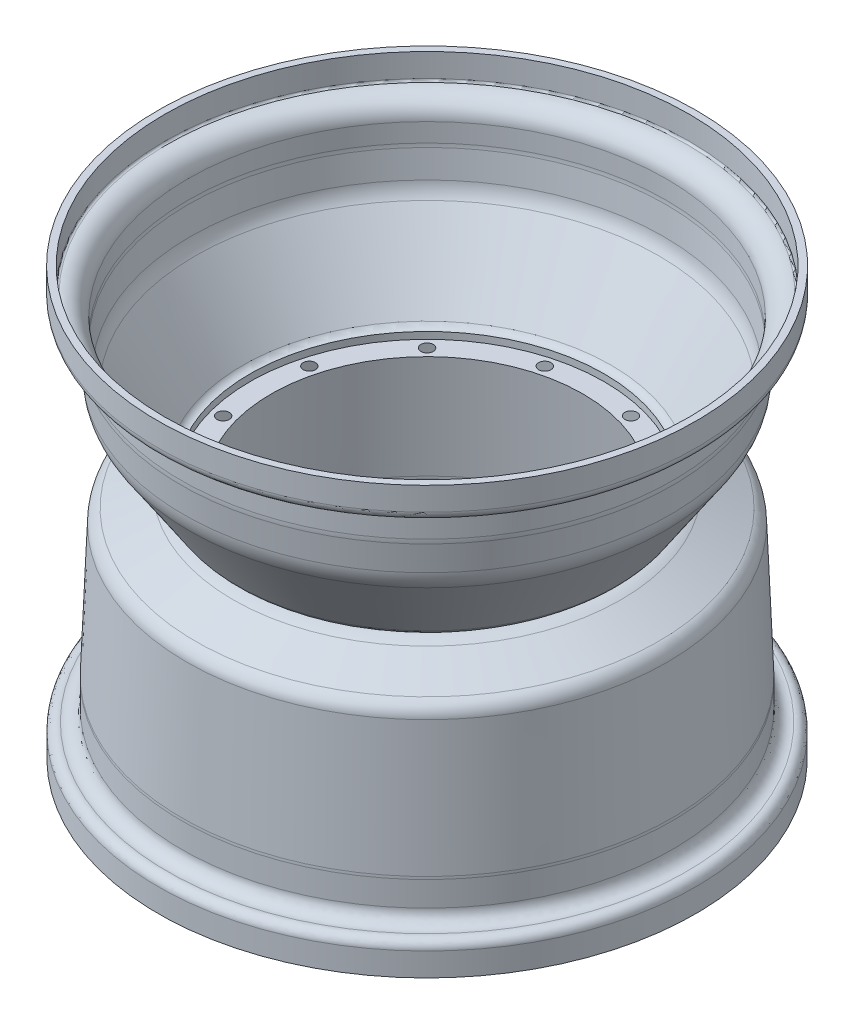
ISO-10303-21;
HEADER;
FILE_DESCRIPTION(('STEP AP214'),'2;1');
FILE_NAME('part.step','',(''),(''),'','','');
FILE_SCHEMA(('AUTOMOTIVE_DESIGN { 1 0 10303 214 1 1 1 1 }'));
ENDSEC;
DATA;
#1=APPLICATION_CONTEXT('core data for automotive mechanical design processes');
#2=APPLICATION_PROTOCOL_DEFINITION('international standard','automotive_design',2000,#1);
#3=PRODUCT_CONTEXT('',#1,'mechanical');
#4=PRODUCT('Part','Part','',(#3));
#5=PRODUCT_RELATED_PRODUCT_CATEGORY('part','',(#4));
#6=PRODUCT_DEFINITION_FORMATION('','',#4);
#7=PRODUCT_DEFINITION_CONTEXT('part definition',#1,'design');
#8=PRODUCT_DEFINITION('design','',#6,#7);
#9=PRODUCT_DEFINITION_SHAPE('','',#8);
#10=(LENGTH_UNIT() NAMED_UNIT(*) SI_UNIT(.MILLI.,.METRE.));
#11=(NAMED_UNIT(*) PLANE_ANGLE_UNIT() SI_UNIT($,.RADIAN.));
#12=(NAMED_UNIT(*) SI_UNIT($,.STERADIAN.) SOLID_ANGLE_UNIT());
#13=UNCERTAINTY_MEASURE_WITH_UNIT(LENGTH_MEASURE(1.E-05),#10,'distance_accuracy_value','');
#14=(GEOMETRIC_REPRESENTATION_CONTEXT(3) GLOBAL_UNCERTAINTY_ASSIGNED_CONTEXT((#13)) GLOBAL_UNIT_ASSIGNED_CONTEXT((#10,
#11,#12)) REPRESENTATION_CONTEXT('',''));
#15=CARTESIAN_POINT('',(0.,0.,0.));
#16=DIRECTION('',(0.,0.,1.));
#17=DIRECTION('',(1.,0.,0.));
#18=AXIS2_PLACEMENT_3D('',#15,#16,#17);
#19=CARTESIAN_POINT('',(0.,20.9847913738796,0.));
#20=DIRECTION('',(0.,-1.,0.));
#21=DIRECTION('',(0.,0.,-1.));
#22=AXIS2_PLACEMENT_3D('',#19,#20,#21);
#23=CYLINDRICAL_SURFACE('',#22,91.1860000000004);
#24=CARTESIAN_POINT('',(0.,16.5472913738795,0.));
#25=DIRECTION('',(0.,-1.,0.));
#26=DIRECTION('',(0.,0.,-1.));
#27=AXIS2_PLACEMENT_3D('',#24,#25,#26);
#28=CIRCLE('',#27,91.1860000000005);
#29=CARTESIAN_POINT('',(0.,16.5472913738795,-91.1860000000005));
#30=VERTEX_POINT('',#29);
#31=EDGE_CURVE('E64',#30,#30,#28,.T.);
#32=ORIENTED_EDGE('',*,*,#31,.F.);
#33=EDGE_LOOP('',(#32));
#34=FACE_BOUND('',#33,.T.);
#35=CARTESIAN_POINT('',(0.,13.0472913738795,0.));
#36=DIRECTION('',(0.,-1.,0.));
#37=DIRECTION('',(0.,0.,-1.));
#38=AXIS2_PLACEMENT_3D('',#35,#36,#37);
#39=CIRCLE('',#38,91.1860000000005);
#40=CARTESIAN_POINT('',(0.,13.0472913738795,-91.1860000000005));
#41=VERTEX_POINT('',#40);
#42=EDGE_CURVE('E68',#41,#41,#39,.T.);
#43=ORIENTED_EDGE('',*,*,#42,.T.);
#44=EDGE_LOOP('',(#43));
#45=FACE_BOUND('',#44,.T.);
#46=ADVANCED_FACE('F46',(#34,#45),#23,.F.);
#47=CARTESIAN_POINT('',(0.,110.365316058993,0.));
#48=DIRECTION('',(0.,1.,0.));
#49=DIRECTION('',(0.,0.,1.));
#50=AXIS2_PLACEMENT_3D('',#47,#48,#49);
#51=PLANE('',#50);
#52=CARTESIAN_POINT('',(0.,110.365316058993,0.));
#53=DIRECTION('',(0.,-1.,0.));
#54=DIRECTION('',(0.,0.,-1.));
#55=AXIS2_PLACEMENT_3D('',#52,#53,#54);
#56=CIRCLE('',#55,135.055289406168);
#57=CARTESIAN_POINT('',(0.,110.365316058993,-135.055289406168));
#58=VERTEX_POINT('',#57);
#59=EDGE_CURVE('E11',#58,#58,#56,.T.);
#60=ORIENTED_EDGE('',*,*,#59,.T.);
#61=EDGE_LOOP('',(#60));
#62=FACE_BOUND('',#61,.T.);
#63=CARTESIAN_POINT('',(0.,110.365316058993,0.));
#64=DIRECTION('',(0.,-1.,0.));
#65=DIRECTION('',(0.,0.,-1.));
#66=AXIS2_PLACEMENT_3D('',#63,#64,#65);
#67=CIRCLE('',#66,138.555289406168);
#68=CARTESIAN_POINT('',(0.,110.365316058993,-138.555289406168));
#69=VERTEX_POINT('',#68);
#70=EDGE_CURVE('E91',#69,#69,#67,.T.);
#71=ORIENTED_EDGE('',*,*,#70,.F.);
#72=EDGE_LOOP('',(#71));
#73=FACE_BOUND('',#72,.T.);
#74=ADVANCED_FACE('F116',(#62,#73),#51,.T.);
#75=CARTESIAN_POINT('',(0.,55.,0.));
#76=DIRECTION('',(0.,-1.,0.));
#77=DIRECTION('',(0.,0.,-1.));
#78=AXIS2_PLACEMENT_3D('',#75,#76,#77);
#79=CYLINDRICAL_SURFACE('',#78,135.055289406168);
#80=CARTESIAN_POINT('',(0.,98.2988444671979,0.));
#81=DIRECTION('',(0.,-1.,0.));
#82=DIRECTION('',(0.,0.,-1.));
#83=AXIS2_PLACEMENT_3D('',#80,#81,#82);
#84=CIRCLE('',#83,135.055289406168);
#85=CARTESIAN_POINT('',(0.,98.2988444671979,-135.055289406168));
#86=VERTEX_POINT('',#85);
#87=EDGE_CURVE('E53',#86,#86,#84,.T.);
#88=ORIENTED_EDGE('',*,*,#87,.T.);
#89=EDGE_LOOP('',(#88));
#90=FACE_BOUND('',#89,.T.);
#91=ORIENTED_EDGE('',*,*,#59,.F.);
#92=EDGE_LOOP('',(#91));
#93=FACE_BOUND('',#92,.T.);
#94=ADVANCED_FACE('F121',(#90,#93),#79,.F.);
#95=CARTESIAN_POINT('',(0.,98.2420105318187,0.));
#96=DIRECTION('',(0.,-1.,0.));
#97=DIRECTION('',(0.,0.,-1.));
#98=AXIS2_PLACEMENT_3D('',#95,#96,#97);
#99=TOROIDAL_SURFACE('',#98,134.112,0.944999999999911);
#100=CARTESIAN_POINT('',(0.,97.301747403753,0.));
#101=DIRECTION('',(0.,-1.,0.));
#102=DIRECTION('',(0.,0.,-1.));
#103=AXIS2_PLACEMENT_3D('',#100,#101,#102);
#104=CIRCLE('',#103,134.0175);
#105=CARTESIAN_POINT('',(0.,97.301747403753,-134.0175));
#106=VERTEX_POINT('',#105);
#107=EDGE_CURVE('E58',#106,#106,#104,.T.);
#108=ORIENTED_EDGE('',*,*,#107,.T.);
#109=EDGE_LOOP('',(#108));
#110=FACE_BOUND('',#109,.T.);
#111=ORIENTED_EDGE('',*,*,#87,.F.);
#112=EDGE_LOOP('',(#111));
#113=FACE_BOUND('',#112,.T.);
#114=ADVANCED_FACE('F191',(#110,#113),#99,.F.);
#115=CARTESIAN_POINT('',(0.,87.5011211482528,0.));
#116=DIRECTION('',(0.,-1.,0.));
#117=DIRECTION('',(0.,0.,-1.));
#118=AXIS2_PLACEMENT_3D('',#115,#116,#117);
#119=TOROIDAL_SURFACE('',#118,133.0325,9.84999999999996);
#120=CARTESIAN_POINT('',(0.,87.5011211482528,0.));
#121=DIRECTION('',(0.,-1.,0.));
#122=DIRECTION('',(0.,0.,-1.));
#123=AXIS2_PLACEMENT_3D('',#120,#121,#122);
#124=CIRCLE('',#123,123.1825);
#125=CARTESIAN_POINT('',(0.,87.5011211482528,-123.1825));
#126=VERTEX_POINT('',#125);
#127=EDGE_CURVE('E318',#126,#126,#124,.T.);
#128=ORIENTED_EDGE('',*,*,#127,.T.);
#129=EDGE_LOOP('',(#128));
#130=FACE_BOUND('',#129,.T.);
#131=ORIENTED_EDGE('',*,*,#107,.F.);
#132=EDGE_LOOP('',(#131));
#133=FACE_BOUND('',#132,.T.);
#134=ADVANCED_FACE('F187',(#130,#133),#119,.T.);
#135=CARTESIAN_POINT('',(0.,55.,0.));
#136=DIRECTION('',(0.,-1.,0.));
#137=DIRECTION('',(0.,0.,-1.));
#138=AXIS2_PLACEMENT_3D('',#135,#136,#137);
#139=CYLINDRICAL_SURFACE('',#138,123.1825);
#140=CARTESIAN_POINT('',(0.,77.9442913738797,0.));
#141=DIRECTION('',(0.,-1.,0.));
#142=DIRECTION('',(0.,0.,-1.));
#143=AXIS2_PLACEMENT_3D('',#140,#141,#142);
#144=CIRCLE('',#143,123.1825);
#145=CARTESIAN_POINT('',(0.,77.9442913738797,-123.1825));
#146=VERTEX_POINT('',#145);
#147=EDGE_CURVE('E321',#146,#146,#144,.T.);
#148=ORIENTED_EDGE('',*,*,#147,.T.);
#149=EDGE_LOOP('',(#148));
#150=FACE_BOUND('',#149,.T.);
#151=ORIENTED_EDGE('',*,*,#127,.F.);
#152=EDGE_LOOP('',(#151));
#153=FACE_BOUND('',#152,.T.);
#154=ADVANCED_FACE('F183',(#150,#153),#139,.F.);
#155=CARTESIAN_POINT('',(0.,77.9442913738795,0.));
#156=DIRECTION('',(0.,-1.,0.));
#157=DIRECTION('',(0.,0.,-1.));
#158=AXIS2_PLACEMENT_3D('',#155,#156,#157);
#159=TOROIDAL_SURFACE('',#158,101.2825,21.8999999999999);
#160=CARTESIAN_POINT('',(0.,76.0355806077061,0.));
#161=DIRECTION('',(0.,-1.,0.));
#162=DIRECTION('',(0.,0.,-1.));
#163=AXIS2_PLACEMENT_3D('',#160,#161,#162);
#164=CIRCLE('',#163,123.099163888209);
#165=CARTESIAN_POINT('',(0.,76.0355806077061,-123.099163888209));
#166=VERTEX_POINT('',#165);
#167=EDGE_CURVE('E326',#166,#166,#164,.T.);
#168=ORIENTED_EDGE('',*,*,#167,.T.);
#169=EDGE_LOOP('',(#168));
#170=FACE_BOUND('',#169,.T.);
#171=ORIENTED_EDGE('',*,*,#147,.F.);
#172=EDGE_LOOP('',(#171));
#173=FACE_BOUND('',#172,.T.);
#174=ADVANCED_FACE('F179',(#170,#173),#159,.F.);
#175=CARTESIAN_POINT('',(0.,76.0355806077062,0.));
#176=DIRECTION('',(0.,1.,0.));
#177=DIRECTION('',(0.,0.,1.));
#178=AXIS2_PLACEMENT_3D('',#175,#176,#177);
#179=CONICAL_SURFACE('',#178,123.099163888209,0.0872664625997217);
#180=CARTESIAN_POINT('',(0.,62.3743364734966,0.));
#181=DIRECTION('',(0.,1.,0.));
#182=DIRECTION('',(0.,0.,1.));
#183=AXIS2_PLACEMENT_3D('',#180,#181,#182);
#184=CIRCLE('',#183,121.903959896806);
#185=CARTESIAN_POINT('',(0.,62.3743364734966,121.903959896806));
#186=VERTEX_POINT('',#185);
#187=EDGE_CURVE('E329',#186,#186,#184,.F.);
#188=ORIENTED_EDGE('',*,*,#187,.T.);
#189=EDGE_LOOP('',(#188));
#190=FACE_BOUND('',#189,.T.);
#191=ORIENTED_EDGE('',*,*,#167,.F.);
#192=EDGE_LOOP('',(#191));
#193=FACE_BOUND('',#192,.T.);
#194=ADVANCED_FACE('F175',(#190,#193),#179,.F.);
#195=CARTESIAN_POINT('',(0.,63.7296082732224,0.));
#196=DIRECTION('',(0.,-1.,0.));
#197=DIRECTION('',(0.,0.,-1.));
#198=AXIS2_PLACEMENT_3D('',#195,#196,#197);
#199=TOROIDAL_SURFACE('',#198,106.413132341479,15.55);
#200=CARTESIAN_POINT('',(0.,55.0829549871006,0.));
#201=DIRECTION('',(0.,-1.,0.));
#202=DIRECTION('',(0.,0.,-1.));
#203=AXIS2_PLACEMENT_3D('',#200,#201,#202);
#204=CIRCLE('',#203,119.337446131758);
#205=CARTESIAN_POINT('',(0.,55.0829549871006,-119.337446131758));
#206=VERTEX_POINT('',#205);
#207=EDGE_CURVE('E67',#206,#206,#204,.T.);
#208=ORIENTED_EDGE('',*,*,#207,.T.);
#209=EDGE_LOOP('',(#208));
#210=FACE_BOUND('',#209,.T.);
#211=ORIENTED_EDGE('',*,*,#187,.F.);
#212=EDGE_LOOP('',(#211));
#213=FACE_BOUND('',#212,.T.);
#214=ADVANCED_FACE('F171',(#210,#213),#199,.F.);
#215=CARTESIAN_POINT('',(0.,55.0829549871006,0.));
#216=DIRECTION('',(0.,1.,0.));
#217=DIRECTION('',(0.,0.,1.));
#218=AXIS2_PLACEMENT_3D('',#215,#216,#217);
#219=CONICAL_SURFACE('',#218,119.337446131758,0.58963160852596);
#220=CARTESIAN_POINT('',(0.,18.517297871811,0.));
#221=DIRECTION('',(0.,1.,0.));
#222=DIRECTION('',(0.,0.,1.));
#223=AXIS2_PLACEMENT_3D('',#220,#221,#222);
#224=CIRCLE('',#223,94.8742085173229);
#225=CARTESIAN_POINT('',(0.,18.517297871811,94.8742085173229));
#226=VERTEX_POINT('',#225);
#227=EDGE_CURVE('E62',#226,#226,#224,.F.);
#228=ORIENTED_EDGE('',*,*,#227,.T.);
#229=EDGE_LOOP('',(#228));
#230=FACE_BOUND('',#229,.T.);
#231=ORIENTED_EDGE('',*,*,#207,.F.);
#232=EDGE_LOOP('',(#231));
#233=FACE_BOUND('',#232,.T.);
#234=ADVANCED_FACE('F112',(#230,#233),#219,.F.);
#235=CARTESIAN_POINT('',(0.,20.9847913738796,0.));
#236=DIRECTION('',(0.,-1.,0.));
#237=DIRECTION('',(0.,0.,-1.));
#238=AXIS2_PLACEMENT_3D('',#235,#236,#237);
#239=TOROIDAL_SURFACE('',#238,91.1860000000004,4.43750000000004);
#240=ORIENTED_EDGE('',*,*,#31,.T.);
#241=EDGE_LOOP('',(#240));
#242=FACE_BOUND('',#241,.T.);
#243=ORIENTED_EDGE('',*,*,#227,.F.);
#244=EDGE_LOOP('',(#243));
#245=FACE_BOUND('',#244,.T.);
#246=ADVANCED_FACE('F103',(#242,#245),#239,.F.);
#247=CARTESIAN_POINT('',(0.,55.,0.));
#248=DIRECTION('',(0.,-1.,0.));
#249=DIRECTION('',(0.,0.,-1.));
#250=AXIS2_PLACEMENT_3D('',#247,#248,#249);
#251=CYLINDRICAL_SURFACE('',#250,138.555289406168);
#252=CARTESIAN_POINT('',(0.,98.3653160589928,0.));
#253=DIRECTION('',(0.,-1.,0.));
#254=DIRECTION('',(0.,0.,-1.));
#255=AXIS2_PLACEMENT_3D('',#252,#253,#254);
#256=CIRCLE('',#255,138.555289406168);
#257=CARTESIAN_POINT('',(0.,98.3653160589928,-138.555289406168));
#258=VERTEX_POINT('',#257);
#259=EDGE_CURVE('E49',#258,#258,#256,.T.);
#260=ORIENTED_EDGE('',*,*,#259,.F.);
#261=EDGE_LOOP('',(#260));
#262=FACE_BOUND('',#261,.T.);
#263=ORIENTED_EDGE('',*,*,#70,.T.);
#264=EDGE_LOOP('',(#263));
#265=FACE_BOUND('',#264,.T.);
#266=ADVANCED_FACE('F101',(#262,#265),#251,.T.);
#267=CARTESIAN_POINT('',(0.,98.2420105318187,0.));
#268=DIRECTION('',(0.,-1.,0.));
#269=DIRECTION('',(0.,0.,-1.));
#270=AXIS2_PLACEMENT_3D('',#267,#268,#269);
#271=TOROIDAL_SURFACE('',#270,134.112,4.44499999999991);
#272=CARTESIAN_POINT('',(0.,93.8192913738798,0.));
#273=DIRECTION('',(0.,-1.,0.));
#274=DIRECTION('',(0.,0.,-1.));
#275=AXIS2_PLACEMENT_3D('',#272,#273,#274);
#276=CIRCLE('',#275,133.667500000001);
#277=CARTESIAN_POINT('',(0.,93.8192913738798,-133.667500000001));
#278=VERTEX_POINT('',#277);
#279=EDGE_CURVE('E89',#278,#278,#276,.T.);
#280=ORIENTED_EDGE('',*,*,#279,.F.);
#281=EDGE_LOOP('',(#280));
#282=FACE_BOUND('',#281,.T.);
#283=ORIENTED_EDGE('',*,*,#259,.T.);
#284=EDGE_LOOP('',(#283));
#285=FACE_BOUND('',#284,.T.);
#286=ADVANCED_FACE('F99',(#282,#285),#271,.T.);
#287=CARTESIAN_POINT('',(0.,87.5011211482528,0.));
#288=DIRECTION('',(0.,-1.,0.));
#289=DIRECTION('',(0.,0.,-1.));
#290=AXIS2_PLACEMENT_3D('',#287,#288,#289);
#291=TOROIDAL_SURFACE('',#290,133.0325,6.34999999999996);
#292=CARTESIAN_POINT('',(0.,87.5011211482528,0.));
#293=DIRECTION('',(0.,-1.,0.));
#294=DIRECTION('',(0.,0.,-1.));
#295=AXIS2_PLACEMENT_3D('',#292,#293,#294);
#296=CIRCLE('',#295,126.6825);
#297=CARTESIAN_POINT('',(0.,87.5011211482528,-126.6825));
#298=VERTEX_POINT('',#297);
#299=EDGE_CURVE('E86',#298,#298,#296,.T.);
#300=ORIENTED_EDGE('',*,*,#299,.F.);
#301=EDGE_LOOP('',(#300));
#302=FACE_BOUND('',#301,.T.);
#303=ORIENTED_EDGE('',*,*,#279,.T.);
#304=EDGE_LOOP('',(#303));
#305=FACE_BOUND('',#304,.T.);
#306=ADVANCED_FACE('F109',(#302,#305),#291,.F.);
#307=CARTESIAN_POINT('',(0.,55.,0.));
#308=DIRECTION('',(0.,-1.,0.));
#309=DIRECTION('',(0.,0.,-1.));
#310=AXIS2_PLACEMENT_3D('',#307,#308,#309);
#311=CYLINDRICAL_SURFACE('',#310,126.6825);
#312=CARTESIAN_POINT('',(0.,77.9442913738797,0.));
#313=DIRECTION('',(0.,-1.,0.));
#314=DIRECTION('',(0.,0.,-1.));
#315=AXIS2_PLACEMENT_3D('',#312,#313,#314);
#316=CIRCLE('',#315,126.6825);
#317=CARTESIAN_POINT('',(0.,77.9442913738797,-126.6825));
#318=VERTEX_POINT('',#317);
#319=EDGE_CURVE('E83',#318,#318,#316,.T.);
#320=ORIENTED_EDGE('',*,*,#319,.F.);
#321=EDGE_LOOP('',(#320));
#322=FACE_BOUND('',#321,.T.);
#323=ORIENTED_EDGE('',*,*,#299,.T.);
#324=EDGE_LOOP('',(#323));
#325=FACE_BOUND('',#324,.T.);
#326=ADVANCED_FACE('F153',(#322,#325),#311,.T.);
#327=CARTESIAN_POINT('',(0.,77.9442913738795,0.));
#328=DIRECTION('',(0.,-1.,0.));
#329=DIRECTION('',(0.,0.,-1.));
#330=AXIS2_PLACEMENT_3D('',#327,#328,#329);
#331=TOROIDAL_SURFACE('',#330,101.2825,25.3999999999999);
#332=CARTESIAN_POINT('',(0.,75.7305355080894,0.));
#333=DIRECTION('',(0.,-1.,0.));
#334=DIRECTION('',(0.,0.,-1.));
#335=AXIS2_PLACEMENT_3D('',#332,#333,#334);
#336=CIRCLE('',#335,126.58584533153);
#337=CARTESIAN_POINT('',(0.,75.7305355080894,-126.58584533153));
#338=VERTEX_POINT('',#337);
#339=EDGE_CURVE('E80',#338,#338,#336,.T.);
#340=ORIENTED_EDGE('',*,*,#339,.F.);
#341=EDGE_LOOP('',(#340));
#342=FACE_BOUND('',#341,.T.);
#343=ORIENTED_EDGE('',*,*,#319,.T.);
#344=EDGE_LOOP('',(#343));
#345=FACE_BOUND('',#344,.T.);
#346=ADVANCED_FACE('F147',(#342,#345),#331,.T.);
#347=CARTESIAN_POINT('',(0.,75.7305355080894,0.));
#348=DIRECTION('',(0.,1.,0.));
#349=DIRECTION('',(0.,0.,1.));
#350=AXIS2_PLACEMENT_3D('',#347,#348,#349);
#351=CONICAL_SURFACE('',#350,126.58584533153,0.0872664625997217);
#352=CARTESIAN_POINT('',(0.,62.0692913738798,0.));
#353=DIRECTION('',(0.,-1.,0.));
#354=DIRECTION('',(0.,0.,-1.));
#355=AXIS2_PLACEMENT_3D('',#352,#353,#354);
#356=CIRCLE('',#355,125.390641340127);
#357=CARTESIAN_POINT('',(0.,62.0692913738798,-125.390641340127));
#358=VERTEX_POINT('',#357);
#359=EDGE_CURVE('E77',#358,#358,#356,.T.);
#360=ORIENTED_EDGE('',*,*,#359,.F.);
#361=EDGE_LOOP('',(#360));
#362=FACE_BOUND('',#361,.T.);
#363=ORIENTED_EDGE('',*,*,#339,.T.);
#364=EDGE_LOOP('',(#363));
#365=FACE_BOUND('',#364,.T.);
#366=ADVANCED_FACE('F141',(#362,#365),#351,.T.);
#367=CARTESIAN_POINT('',(0.,63.7296082732224,0.));
#368=DIRECTION('',(0.,-1.,0.));
#369=DIRECTION('',(0.,0.,-1.));
#370=AXIS2_PLACEMENT_3D('',#367,#368,#369);
#371=TOROIDAL_SURFACE('',#370,106.413132341479,19.05);
#372=CARTESIAN_POINT('',(0.,53.1367629291311,0.));
#373=DIRECTION('',(0.,-1.,0.));
#374=DIRECTION('',(0.,0.,-1.));
#375=AXIS2_PLACEMENT_3D('',#372,#373,#374);
#376=CIRCLE('',#375,122.246455666548);
#377=CARTESIAN_POINT('',(0.,53.1367629291311,-122.246455666548));
#378=VERTEX_POINT('',#377);
#379=EDGE_CURVE('E71',#378,#378,#376,.T.);
#380=ORIENTED_EDGE('',*,*,#379,.F.);
#381=EDGE_LOOP('',(#380));
#382=FACE_BOUND('',#381,.T.);
#383=ORIENTED_EDGE('',*,*,#359,.T.);
#384=EDGE_LOOP('',(#383));
#385=FACE_BOUND('',#384,.T.);
#386=ADVANCED_FACE('F135',(#382,#385),#371,.T.);
#387=CARTESIAN_POINT('',(0.,53.1367629291311,0.));
#388=DIRECTION('',(0.,1.,0.));
#389=DIRECTION('',(0.,0.,1.));
#390=AXIS2_PLACEMENT_3D('',#387,#388,#389);
#391=CONICAL_SURFACE('',#390,122.246455666548,0.58963160852596);
#392=CARTESIAN_POINT('',(0.,16.5711058138414,0.));
#393=DIRECTION('',(0.,-1.,0.));
#394=DIRECTION('',(0.,0.,-1.));
#395=AXIS2_PLACEMENT_3D('',#392,#393,#394);
#396=CIRCLE('',#395,97.7832180521124);
#397=CARTESIAN_POINT('',(0.,16.5711058138414,-97.7832180521124));
#398=VERTEX_POINT('',#397);
#399=EDGE_CURVE('E72',#398,#398,#396,.T.);
#400=ORIENTED_EDGE('',*,*,#399,.F.);
#401=EDGE_LOOP('',(#400));
#402=FACE_BOUND('',#401,.T.);
#403=ORIENTED_EDGE('',*,*,#379,.T.);
#404=EDGE_LOOP('',(#403));
#405=FACE_BOUND('',#404,.T.);
#406=ADVANCED_FACE('F129',(#402,#405),#391,.T.);
#407=CARTESIAN_POINT('',(0.,20.9847913738796,0.));
#408=DIRECTION('',(0.,-1.,0.));
#409=DIRECTION('',(0.,0.,-1.));
#410=AXIS2_PLACEMENT_3D('',#407,#408,#409);
#411=TOROIDAL_SURFACE('',#410,91.1860000000004,7.93750000000004);
#412=ORIENTED_EDGE('',*,*,#42,.F.);
#413=EDGE_LOOP('',(#412));
#414=FACE_BOUND('',#413,.T.);
#415=ORIENTED_EDGE('',*,*,#399,.T.);
#416=EDGE_LOOP('',(#415));
#417=FACE_BOUND('',#416,.T.);
#418=ADVANCED_FACE('F126',(#414,#417),#411,.T.);
#419=CLOSED_SHELL('',(#46,#74,#94,#114,#134,#154,#174,#194,#214,#234,#246,#266,#286,#306,#326,
#346,#366,#386,#406,#418));
#420=MANIFOLD_SOLID_BREP('B2',#419);
#421=CARTESIAN_POINT('',(0.,55.,0.));
#422=DIRECTION('',(0.,-1.,0.));
#423=DIRECTION('',(0.,0.,-1.));
#424=AXIS2_PLACEMENT_3D('',#421,#422,#423);
#425=CYLINDRICAL_SURFACE('',#424,138.427487940002);
#426=CARTESIAN_POINT('',(0.,-97.4001828184885,0.));
#427=DIRECTION('',(0.,-1.,0.));
#428=DIRECTION('',(0.,0.,-1.));
#429=AXIS2_PLACEMENT_3D('',#426,#427,#428);
#430=CIRCLE('',#429,138.427487940002);
#431=CARTESIAN_POINT('',(0.,-97.4001828184885,-138.427487940002));
#432=VERTEX_POINT('',#431);
#433=EDGE_CURVE('E357',#432,#432,#430,.T.);
#434=ORIENTED_EDGE('',*,*,#433,.T.);
#435=EDGE_LOOP('',(#434));
#436=FACE_BOUND('',#435,.T.);
#437=CARTESIAN_POINT('',(0.,-109.400182818489,0.));
#438=DIRECTION('',(0.,-1.,0.));
#439=DIRECTION('',(0.,0.,-1.));
#440=AXIS2_PLACEMENT_3D('',#437,#438,#439);
#441=CIRCLE('',#440,138.427487940002);
#442=CARTESIAN_POINT('',(0.,-109.400182818489,-138.427487940002));
#443=VERTEX_POINT('',#442);
#444=EDGE_CURVE('E45',#443,#443,#441,.T.);
#445=ORIENTED_EDGE('',*,*,#444,.F.);
#446=EDGE_LOOP('',(#445));
#447=FACE_BOUND('',#446,.T.);
#448=ADVANCED_FACE('F355',(#436,#447),#425,.T.);
#449=CARTESIAN_POINT('',(0.,-97.4001828184885,138.427487940002));
#450=CARTESIAN_POINT('',(0.,-95.0050608254273,138.427487940002));
#451=CARTESIAN_POINT('',(0.,-92.6729013501488,136.705561076159));
#452=CARTESIAN_POINT('',(0.,-93.1247086261212,133.519735500002));
#453=(BOUNDED_CURVE() B_SPLINE_CURVE(3,(#449,#450,#451,#452),.UNSPECIFIED.,.F.,
.F.) B_SPLINE_CURVE_WITH_KNOTS((4,4),(0.,1.),
.UNSPECIFIED.) CURVE() GEOMETRIC_REPRESENTATION_ITEM() RATIONAL_B_SPLINE_CURVE((0.508666190060503,
0.327183181081988,0.242825015050017,0.255591691964592)) REPRESENTATION_ITEM(''));
#454=CARTESIAN_POINT('',(0.,55.,0.));
#455=DIRECTION('',(0.,-1.,0.));
#456=AXIS1_PLACEMENT('',#454,#455);
#457=SURFACE_OF_REVOLUTION('',#453,#456);
#458=CARTESIAN_POINT('',(0.,-93.1247086261212,0.));
#459=DIRECTION('',(0.,-1.,0.));
#460=DIRECTION('',(0.,0.,-1.));
#461=AXIS2_PLACEMENT_3D('',#458,#459,#460);
#462=CIRCLE('',#461,133.519735500002);
#463=CARTESIAN_POINT('',(0.,-93.1247086261212,-133.519735500002));
#464=VERTEX_POINT('',#463);
#465=EDGE_CURVE('E366',#464,#464,#462,.T.);
#466=ORIENTED_EDGE('',*,*,#465,.T.);
#467=EDGE_LOOP('',(#466));
#468=FACE_BOUND('',#467,.T.);
#469=ORIENTED_EDGE('',*,*,#433,.F.);
#470=EDGE_LOOP('',(#469));
#471=FACE_BOUND('',#470,.T.);
#472=ADVANCED_FACE('F405',(#468,#471),#457,.F.);
#473=CARTESIAN_POINT('',(0.,-93.1247086261212,133.519735500002));
#474=CARTESIAN_POINT('',(0.,-93.7891310907864,128.834697888006));
#475=CARTESIAN_POINT('',(0.,-90.3594848036121,126.302452500002));
#476=CARTESIAN_POINT('',(0.,-86.8372465785219,126.302452500002));
#477=(BOUNDED_CURVE() B_SPLINE_CURVE(3,(#473,#474,#475,#476),.UNSPECIFIED.,.F.,
.F.) B_SPLINE_CURVE_WITH_KNOTS((4,4),(0.,1.),
.UNSPECIFIED.) CURVE() GEOMETRIC_REPRESENTATION_ITEM() RATIONAL_B_SPLINE_CURVE((0.255591691964593,
0.242825015050018,0.327183181081988,0.508666190060503)) REPRESENTATION_ITEM(''));
#478=CARTESIAN_POINT('',(0.,55.,0.));
#479=DIRECTION('',(0.,-1.,0.));
#480=AXIS1_PLACEMENT('',#478,#479);
#481=SURFACE_OF_REVOLUTION('',#477,#480);
#482=CARTESIAN_POINT('',(0.,-86.8372465785219,0.));
#483=DIRECTION('',(0.,-1.,0.));
#484=DIRECTION('',(0.,0.,-1.));
#485=AXIS2_PLACEMENT_3D('',#482,#483,#484);
#486=CIRCLE('',#485,126.302452500002);
#487=CARTESIAN_POINT('',(0.,-86.8372465785219,-126.302452500002));
#488=VERTEX_POINT('',#487);
#489=EDGE_CURVE('E370',#488,#488,#486,.T.);
#490=ORIENTED_EDGE('',*,*,#489,.T.);
#491=EDGE_LOOP('',(#490));
#492=FACE_BOUND('',#491,.T.);
#493=ORIENTED_EDGE('',*,*,#465,.F.);
#494=EDGE_LOOP('',(#493));
#495=FACE_BOUND('',#494,.T.);
#496=ADVANCED_FACE('F408',(#492,#495),#481,.F.);
#497=CARTESIAN_POINT('',(0.,55.,0.));
#498=DIRECTION('',(0.,-1.,0.));
#499=DIRECTION('',(0.,0.,-1.));
#500=AXIS2_PLACEMENT_3D('',#497,#498,#499);
#501=CYLINDRICAL_SURFACE('',#500,126.302452500002);
#502=CARTESIAN_POINT('',(0.,-74.0828852821459,0.));
#503=DIRECTION('',(0.,-1.,0.));
#504=DIRECTION('',(0.,0.,-1.));
#505=AXIS2_PLACEMENT_3D('',#502,#503,#504);
#506=CIRCLE('',#505,126.302452500002);
#507=CARTESIAN_POINT('',(0.,-74.0828852821459,-126.302452500002));
#508=VERTEX_POINT('',#507);
#509=EDGE_CURVE('E373',#508,#508,#506,.T.);
#510=ORIENTED_EDGE('',*,*,#509,.T.);
#511=EDGE_LOOP('',(#510));
#512=FACE_BOUND('',#511,.T.);
#513=ORIENTED_EDGE('',*,*,#489,.F.);
#514=EDGE_LOOP('',(#513));
#515=FACE_BOUND('',#514,.T.);
#516=ADVANCED_FACE('F412',(#512,#515),#501,.T.);
#517=CARTESIAN_POINT('',(0.,-74.0828852821458,0.));
#518=DIRECTION('',(0.,-1.,0.));
#519=DIRECTION('',(0.,0.,-1.));
#520=AXIS2_PLACEMENT_3D('',#517,#518,#519);
#521=TOROIDAL_SURFACE('',#520,91.302452500002,35.);
#522=CARTESIAN_POINT('',(0.,-72.7393119640824,0.));
#523=DIRECTION('',(0.,-1.,0.));
#524=DIRECTION('',(0.,0.,-1.));
#525=AXIS2_PLACEMENT_3D('',#522,#523,#524);
#526=CIRCLE('',#525,126.276654574374);
#527=CARTESIAN_POINT('',(0.,-72.7393119640824,-126.276654574374));
#528=VERTEX_POINT('',#527);
#529=EDGE_CURVE('E376',#528,#528,#526,.T.);
#530=ORIENTED_EDGE('',*,*,#529,.T.);
#531=EDGE_LOOP('',(#530));
#532=FACE_BOUND('',#531,.T.);
#533=ORIENTED_EDGE('',*,*,#509,.F.);
#534=EDGE_LOOP('',(#533));
#535=FACE_BOUND('',#534,.T.);
#536=ADVANCED_FACE('F422',(#532,#535),#521,.T.);
#537=CARTESIAN_POINT('',(0.,-72.7393119640824,0.));
#538=DIRECTION('',(0.,-1.,0.));
#539=DIRECTION('',(0.,0.,-1.));
#540=AXIS2_PLACEMENT_3D('',#537,#538,#539);
#541=CONICAL_SURFACE('',#540,126.276654574374,0.0383972435438753);
#542=CARTESIAN_POINT('',(0.,-4.67176492476311,0.));
#543=DIRECTION('',(0.,-1.,0.));
#544=DIRECTION('',(0.,0.,-1.));
#545=AXIS2_PLACEMENT_3D('',#542,#543,#544);
#546=CIRCLE('',#545,123.661763180038);
#547=CARTESIAN_POINT('',(0.,-4.67176492476311,-123.661763180038));
#548=VERTEX_POINT('',#547);
#549=EDGE_CURVE('E379',#548,#548,#546,.T.);
#550=ORIENTED_EDGE('',*,*,#549,.T.);
#551=EDGE_LOOP('',(#550));
#552=FACE_BOUND('',#551,.T.);
#553=ORIENTED_EDGE('',*,*,#529,.F.);
#554=EDGE_LOOP('',(#553));
#555=FACE_BOUND('',#554,.T.);
#556=ADVANCED_FACE('F426',(#552,#555),#541,.T.);
#557=CARTESIAN_POINT('',(0.,-4.97886739746323,0.));
#558=DIRECTION('',(0.,-1.,0.));
#559=DIRECTION('',(0.,0.,-1.));
#560=AXIS2_PLACEMENT_3D('',#557,#558,#559);
#561=TOROIDAL_SURFACE('',#560,115.667659848753,8.);
#562=CARTESIAN_POINT('',(0.,2.26769556187344,0.));
#563=DIRECTION('',(0.,-1.,0.));
#564=DIRECTION('',(0.,0.,-1.));
#565=AXIS2_PLACEMENT_3D('',#562,#563,#564);
#566=CIRCLE('',#565,119.056955539065);
#567=CARTESIAN_POINT('',(0.,2.26769556187344,-119.056955539065));
#568=VERTEX_POINT('',#567);
#569=EDGE_CURVE('E382',#568,#568,#566,.T.);
#570=ORIENTED_EDGE('',*,*,#569,.T.);
#571=EDGE_LOOP('',(#570));
#572=FACE_BOUND('',#571,.T.);
#573=ORIENTED_EDGE('',*,*,#549,.F.);
#574=EDGE_LOOP('',(#573));
#575=FACE_BOUND('',#574,.T.);
#576=ADVANCED_FACE('F430',(#572,#575),#561,.T.);
#577=CARTESIAN_POINT('',(0.,2.26769556187344,0.));
#578=DIRECTION('',(0.,-1.,0.));
#579=DIRECTION('',(0.,0.,-1.));
#580=AXIS2_PLACEMENT_3D('',#577,#578,#579);
#581=CONICAL_SURFACE('',#580,119.056955539065,1.13331210913777);
#582=CARTESIAN_POINT('',(0.,11.2624547169263,0.));
#583=DIRECTION('',(0.,-1.,0.));
#584=DIRECTION('',(0.,0.,-1.));
#585=AXIS2_PLACEMENT_3D('',#582,#583,#584);
#586=CIRCLE('',#585,99.8255002525088);
#587=CARTESIAN_POINT('',(0.,11.2624547169263,-99.8255002525088));
#588=VERTEX_POINT('',#587);
#589=EDGE_CURVE('E385',#588,#588,#586,.T.);
#590=ORIENTED_EDGE('',*,*,#589,.T.);
#591=EDGE_LOOP('',(#590));
#592=FACE_BOUND('',#591,.T.);
#593=ORIENTED_EDGE('',*,*,#569,.F.);
#594=EDGE_LOOP('',(#593));
#595=FACE_BOUND('',#594,.T.);
#596=ADVANCED_FACE('F434',(#592,#595),#581,.T.);
#597=CARTESIAN_POINT('',(0.,11.2624547169263,99.8255002525088));
#598=CARTESIAN_POINT('',(0.,12.4331662406384,97.3224330848818));
#599=CARTESIAN_POINT('',(0.,13.0472913738793,94.605850648923));
#600=CARTESIAN_POINT('',(0.,13.0472913738795,91.7987750000028));
#601=(BOUNDED_CURVE() B_SPLINE_CURVE(3,(#597,#598,#599,#600),.UNSPECIFIED.,.F.,
.F.) B_SPLINE_CURVE_WITH_KNOTS((4,4),(0.,1.),
.UNSPECIFIED.) CURVE() GEOMETRIC_REPRESENTATION_ITEM() RATIONAL_B_SPLINE_CURVE((0.266833191114025,
0.258499793724843,0.254333095030252,0.254333095030252)) REPRESENTATION_ITEM(''));
#602=CARTESIAN_POINT('',(0.,55.,0.));
#603=DIRECTION('',(0.,-1.,0.));
#604=AXIS1_PLACEMENT('',#602,#603);
#605=SURFACE_OF_REVOLUTION('',#601,#604);
#606=CARTESIAN_POINT('',(0.,13.0472913738795,0.));
#607=DIRECTION('',(0.,-1.,0.));
#608=DIRECTION('',(0.,0.,-1.));
#609=AXIS2_PLACEMENT_3D('',#606,#607,#608);
#610=CIRCLE('',#609,91.7987750000028);
#611=CARTESIAN_POINT('',(0.,13.0472913738795,-91.7987750000028));
#612=VERTEX_POINT('',#611);
#613=EDGE_CURVE('E389',#612,#612,#610,.T.);
#614=ORIENTED_EDGE('',*,*,#613,.T.);
#615=EDGE_LOOP('',(#614));
#616=FACE_BOUND('',#615,.T.);
#617=ORIENTED_EDGE('',*,*,#589,.F.);
#618=EDGE_LOOP('',(#617));
#619=FACE_BOUND('',#618,.T.);
#620=ADVANCED_FACE('F438',(#616,#619),#605,.F.);
#621=CARTESIAN_POINT('',(0.,13.0472913738795,91.7987750000028));
#622=DIRECTION('',(0.,1.,0.));
#623=DIRECTION('',(0.,0.,1.));
#624=AXIS2_PLACEMENT_3D('',#621,#622,#623);
#625=PLANE('',#624);
#626=CARTESIAN_POINT('',(0.,13.0472913738796,0.));
#627=DIRECTION('',(0.,-1.,0.));
#628=DIRECTION('',(0.,0.,-1.));
#629=AXIS2_PLACEMENT_3D('',#626,#627,#628);
#630=CIRCLE('',#629,91.1860000000005);
#631=CARTESIAN_POINT('',(0.,13.0472913738796,-91.1860000000005));
#632=VERTEX_POINT('',#631);
#633=EDGE_CURVE('E388',#632,#632,#630,.T.);
#634=ORIENTED_EDGE('',*,*,#633,.T.);
#635=EDGE_LOOP('',(#634));
#636=FACE_BOUND('',#635,.T.);
#637=ORIENTED_EDGE('',*,*,#613,.F.);
#638=EDGE_LOOP('',(#637));
#639=FACE_BOUND('',#638,.T.);
#640=ADVANCED_FACE('F442',(#636,#639),#625,.T.);
#641=OPEN_SHELL('',(#448,#472,#496,#516,#536,#556,#576,#596,#620,#640));
#642=SHELL_BASED_SURFACE_MODEL('B6',(#641));
#643=CARTESIAN_POINT('',(0.,13.0472913738795,91.1860000000005));
#644=DIRECTION('',(0.,1.,0.));
#645=DIRECTION('',(0.,0.,1.));
#646=AXIS2_PLACEMENT_3D('',#643,#644,#645);
#647=PLANE('',#646);
#648=CARTESIAN_POINT('',(-60.6167288172175,13.0472913738795,60.6167288172161));
#649=DIRECTION('',(0.,1.,0.));
#650=DIRECTION('',(0.,0.,1.));
#651=AXIS2_PLACEMENT_3D('',#648,#649,#650);
#652=CIRCLE('',#651,3.175);
#653=CARTESIAN_POINT('',(-60.6167288172175,13.0472913738795,63.7917288172161));
#654=VERTEX_POINT('',#653);
#655=EDGE_CURVE('E354',#654,#654,#652,.T.);
#656=ORIENTED_EDGE('',*,*,#655,.F.);
#657=EDGE_LOOP('',(#656));
#658=FACE_BOUND('',#657,.T.);
#659=CARTESIAN_POINT('',(-22.1872626414145,13.0472913738795,82.8039914586301));
#660=DIRECTION('',(0.,1.,0.));
#661=DIRECTION('',(0.,0.,1.));
#662=AXIS2_PLACEMENT_3D('',#659,#660,#661);
#663=CIRCLE('',#662,3.175);
#664=CARTESIAN_POINT('',(-22.1872626414145,13.0472913738795,85.9789914586301));
#665=VERTEX_POINT('',#664);
#666=EDGE_CURVE('E543',#665,#665,#663,.T.);
#667=ORIENTED_EDGE('',*,*,#666,.F.);
#668=EDGE_LOOP('',(#667));
#669=FACE_BOUND('',#668,.T.);
#670=CARTESIAN_POINT('',(22.1872626414128,13.0472913738795,82.8039914586306));
#671=DIRECTION('',(0.,1.,0.));
#672=DIRECTION('',(0.,0.,1.));
#673=AXIS2_PLACEMENT_3D('',#670,#671,#672);
#674=CIRCLE('',#673,3.175);
#675=CARTESIAN_POINT('',(22.1872626414128,13.0472913738795,85.9789914586306));
#676=VERTEX_POINT('',#675);
#677=EDGE_CURVE('E550',#676,#676,#674,.T.);
#678=ORIENTED_EDGE('',*,*,#677,.F.);
#679=EDGE_LOOP('',(#678));
#680=FACE_BOUND('',#679,.T.);
#681=CARTESIAN_POINT('',(60.6167288172163,13.0472913738795,60.6167288172173));
#682=DIRECTION('',(0.,1.,0.));
#683=DIRECTION('',(0.,0.,1.));
#684=AXIS2_PLACEMENT_3D('',#681,#682,#683);
#685=CIRCLE('',#684,3.17499999999999);
#686=CARTESIAN_POINT('',(60.6167288172163,13.0472913738795,63.7917288172172));
#687=VERTEX_POINT('',#686);
#688=EDGE_CURVE('E556',#687,#687,#685,.T.);
#689=ORIENTED_EDGE('',*,*,#688,.F.);
#690=EDGE_LOOP('',(#689));
#691=FACE_BOUND('',#690,.T.);
#692=CARTESIAN_POINT('',(82.8039914586302,13.0472913738795,22.1872626414142));
#693=DIRECTION('',(0.,1.,0.));
#694=DIRECTION('',(0.,0.,1.));
#695=AXIS2_PLACEMENT_3D('',#692,#693,#694);
#696=CIRCLE('',#695,3.17499999999999);
#697=CARTESIAN_POINT('',(82.8039914586302,13.0472913738795,25.3622626414142));
#698=VERTEX_POINT('',#697);
#699=EDGE_CURVE('E562',#698,#698,#696,.T.);
#700=ORIENTED_EDGE('',*,*,#699,.F.);
#701=EDGE_LOOP('',(#700));
#702=FACE_BOUND('',#701,.T.);
#703=CARTESIAN_POINT('',(82.8039914586305,13.0472913738795,-22.1872626414131));
#704=DIRECTION('',(0.,1.,0.));
#705=DIRECTION('',(0.,0.,1.));
#706=AXIS2_PLACEMENT_3D('',#703,#704,#705);
#707=CIRCLE('',#706,3.17499999999999);
#708=CARTESIAN_POINT('',(82.8039914586305,13.0472913738795,-19.0122626414131));
#709=VERTEX_POINT('',#708);
#710=EDGE_CURVE('E566',#709,#709,#707,.T.);
#711=ORIENTED_EDGE('',*,*,#710,.F.);
#712=EDGE_LOOP('',(#711));
#713=FACE_BOUND('',#712,.T.);
#714=CARTESIAN_POINT('',(60.6167288172171,13.0472913738795,-60.6167288172165));
#715=DIRECTION('',(0.,1.,0.));
#716=DIRECTION('',(0.,0.,1.));
#717=AXIS2_PLACEMENT_3D('',#714,#715,#716);
#718=CIRCLE('',#717,3.175);
#719=CARTESIAN_POINT('',(60.6167288172171,13.0472913738795,-57.4417288172165));
#720=VERTEX_POINT('',#719);
#721=EDGE_CURVE('E570',#720,#720,#718,.T.);
#722=ORIENTED_EDGE('',*,*,#721,.F.);
#723=EDGE_LOOP('',(#722));
#724=FACE_BOUND('',#723,.T.);
#725=CARTESIAN_POINT('',(22.1872626414139,13.0472913738795,-82.8039914586303));
#726=DIRECTION('',(0.,1.,0.));
#727=DIRECTION('',(0.,0.,1.));
#728=AXIS2_PLACEMENT_3D('',#725,#726,#727);
#729=CIRCLE('',#728,3.17499999999999);
#730=CARTESIAN_POINT('',(22.1872626414139,13.0472913738795,-79.6289914586303));
#731=VERTEX_POINT('',#730);
#732=EDGE_CURVE('E574',#731,#731,#729,.T.);
#733=ORIENTED_EDGE('',*,*,#732,.F.);
#734=EDGE_LOOP('',(#733));
#735=FACE_BOUND('',#734,.T.);
#736=CARTESIAN_POINT('',(-22.1872626414134,13.0472913738795,-82.8039914586304));
#737=DIRECTION('',(0.,1.,0.));
#738=DIRECTION('',(0.,0.,1.));
#739=AXIS2_PLACEMENT_3D('',#736,#737,#738);
#740=CIRCLE('',#739,3.17500000000001);
#741=CARTESIAN_POINT('',(-22.1872626414134,13.0472913738795,-79.6289914586304));
#742=VERTEX_POINT('',#741);
#743=EDGE_CURVE('E578',#742,#742,#740,.T.);
#744=ORIENTED_EDGE('',*,*,#743,.F.);
#745=EDGE_LOOP('',(#744));
#746=FACE_BOUND('',#745,.T.);
#747=CARTESIAN_POINT('',(-60.6167288172167,13.0472913738795,-60.6167288172169));
#748=DIRECTION('',(0.,1.,0.));
#749=DIRECTION('',(0.,0.,1.));
#750=AXIS2_PLACEMENT_3D('',#747,#748,#749);
#751=CIRCLE('',#750,3.175);
#752=CARTESIAN_POINT('',(-60.6167288172167,13.0472913738795,-57.4417288172169));
#753=VERTEX_POINT('',#752);
#754=EDGE_CURVE('E582',#753,#753,#751,.T.);
#755=ORIENTED_EDGE('',*,*,#754,.F.);
#756=EDGE_LOOP('',(#755));
#757=FACE_BOUND('',#756,.T.);
#758=CARTESIAN_POINT('',(-82.8039914586303,13.0472913738795,-22.1872626414136));
#759=DIRECTION('',(0.,1.,0.));
#760=DIRECTION('',(0.,0.,1.));
#761=AXIS2_PLACEMENT_3D('',#758,#759,#760);
#762=CIRCLE('',#761,3.17499999999998);
#763=CARTESIAN_POINT('',(-82.8039914586303,13.0472913738795,-19.0122626414136));
#764=VERTEX_POINT('',#763);
#765=EDGE_CURVE('E586',#764,#764,#762,.T.);
#766=ORIENTED_EDGE('',*,*,#765,.F.);
#767=EDGE_LOOP('',(#766));
#768=FACE_BOUND('',#767,.T.);
#769=CARTESIAN_POINT('',(-82.8039914586303,13.0472913738795,22.1872626414137));
#770=DIRECTION('',(0.,1.,0.));
#771=DIRECTION('',(0.,0.,1.));
#772=AXIS2_PLACEMENT_3D('',#769,#770,#771);
#773=CIRCLE('',#772,3.175);
#774=CARTESIAN_POINT('',(-82.8039914586303,13.0472913738795,25.3622626414137));
#775=VERTEX_POINT('',#774);
#776=EDGE_CURVE('E590',#775,#775,#773,.T.);
#777=ORIENTED_EDGE('',*,*,#776,.F.);
#778=EDGE_LOOP('',(#777));
#779=FACE_BOUND('',#778,.T.);
#780=CARTESIAN_POINT('',(0.,13.0472913738795,0.));
#781=DIRECTION('',(0.,-1.,0.));
#782=DIRECTION('',(0.,0.,-1.));
#783=AXIS2_PLACEMENT_3D('',#780,#781,#782);
#784=CIRCLE('',#783,80.2640000000005);
#785=CARTESIAN_POINT('',(0.,13.0472913738795,-80.2640000000005));
#786=VERTEX_POINT('',#785);
#787=EDGE_CURVE('E594',#786,#786,#784,.T.);
#788=ORIENTED_EDGE('',*,*,#787,.T.);
#789=EDGE_LOOP('',(#788));
#790=FACE_BOUND('',#789,.T.);
#791=CARTESIAN_POINT('',(0.,13.0472913738796,0.));
#792=DIRECTION('',(0.,-1.,0.));
#793=DIRECTION('',(0.,0.,-1.));
#794=AXIS2_PLACEMENT_3D('',#791,#792,#793);
#795=CIRCLE('',#794,91.1860000000005);
#796=CARTESIAN_POINT('',(0.,13.0472913738796,-91.1860000000005));
#797=VERTEX_POINT('',#796);
#798=EDGE_CURVE('E595',#797,#797,#795,.T.);
#799=ORIENTED_EDGE('',*,*,#798,.F.);
#800=EDGE_LOOP('',(#799));
#801=FACE_BOUND('',#800,.T.);
#802=ADVANCED_FACE('F539',(#658,#669,#680,#691,#702,#713,#724,#735,#746,#757,#768,#779,#790,
#801),#647,.T.);
#803=OPEN_SHELL('',(#802));
#804=SHELL_BASED_SURFACE_MODEL('B40',(#803));
#805=ADVANCED_BREP_SHAPE_REPRESENTATION('',(#18,#420),#14);
#806=MANIFOLD_SURFACE_SHAPE_REPRESENTATION('',(#18,#642,#804),#14);
#807=SHAPE_REPRESENTATION('',(#18),#14);
#808=SHAPE_DEFINITION_REPRESENTATION(#9,#807);
#809=SHAPE_REPRESENTATION_RELATIONSHIP('','',#807,#805);
#810=SHAPE_REPRESENTATION_RELATIONSHIP('','',#807,#806);
ENDSEC;
END-ISO-10303-21;
